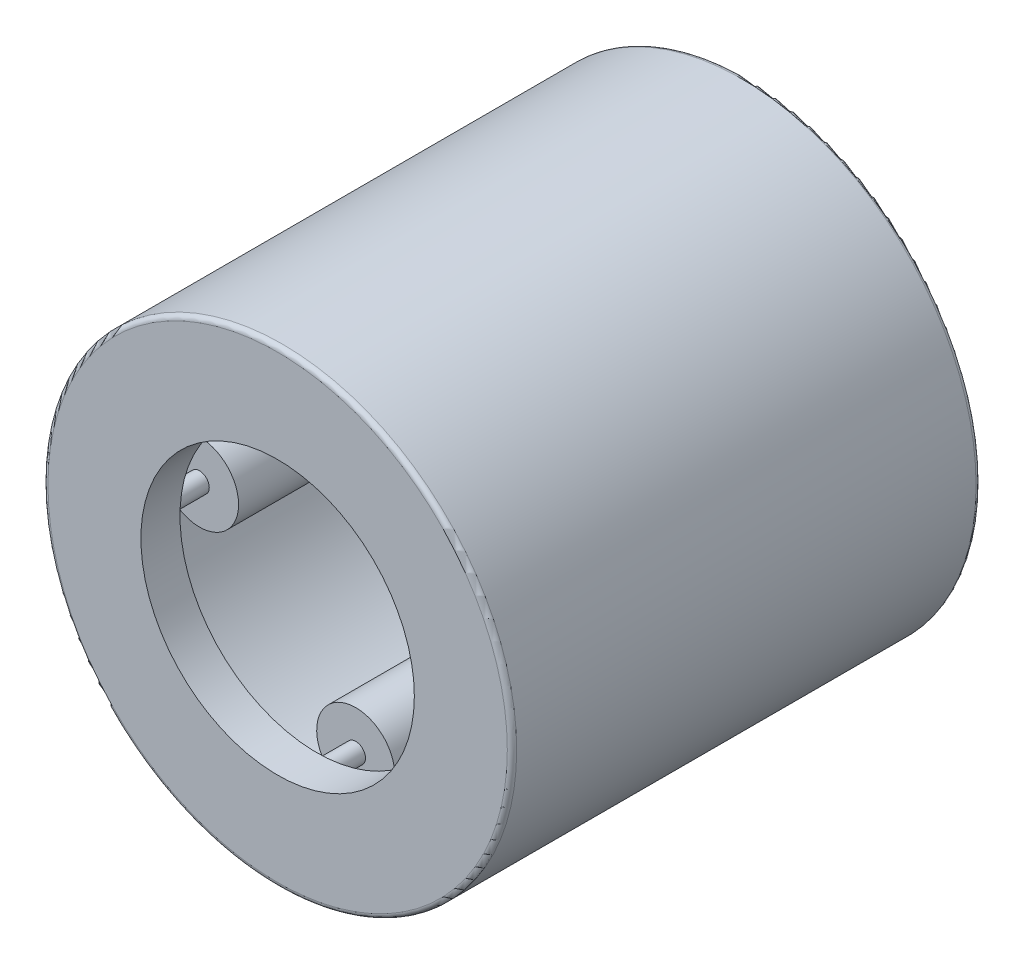
ISO-10303-21;
HEADER;
FILE_DESCRIPTION(('STEP AP214'),'2;1');
FILE_NAME('part.step','',(''),(''),'','','');
FILE_SCHEMA(('AUTOMOTIVE_DESIGN { 1 0 10303 214 1 1 1 1 }'));
ENDSEC;
DATA;
#1=APPLICATION_CONTEXT('core data for automotive mechanical design processes');
#2=APPLICATION_PROTOCOL_DEFINITION('international standard','automotive_design',2000,#1);
#3=PRODUCT_CONTEXT('',#1,'mechanical');
#4=PRODUCT('Part','Part','',(#3));
#5=PRODUCT_RELATED_PRODUCT_CATEGORY('part','',(#4));
#6=PRODUCT_DEFINITION_FORMATION('','',#4);
#7=PRODUCT_DEFINITION_CONTEXT('part definition',#1,'design');
#8=PRODUCT_DEFINITION('design','',#6,#7);
#9=PRODUCT_DEFINITION_SHAPE('','',#8);
#10=(LENGTH_UNIT() NAMED_UNIT(*) SI_UNIT(.MILLI.,.METRE.));
#11=(NAMED_UNIT(*) PLANE_ANGLE_UNIT() SI_UNIT($,.RADIAN.));
#12=(NAMED_UNIT(*) SI_UNIT($,.STERADIAN.) SOLID_ANGLE_UNIT());
#13=UNCERTAINTY_MEASURE_WITH_UNIT(LENGTH_MEASURE(1.E-05),#10,'distance_accuracy_value','');
#14=(GEOMETRIC_REPRESENTATION_CONTEXT(3) GLOBAL_UNCERTAINTY_ASSIGNED_CONTEXT((#13)) GLOBAL_UNIT_ASSIGNED_CONTEXT((#10,
#11,#12)) REPRESENTATION_CONTEXT('',''));
#15=CARTESIAN_POINT('',(0.,0.,0.));
#16=DIRECTION('',(0.,0.,1.));
#17=DIRECTION('',(1.,0.,0.));
#18=AXIS2_PLACEMENT_3D('',#15,#16,#17);
#19=CARTESIAN_POINT('',(-2.11666666666667,0.,2.64583333333333));
#20=DIRECTION('',(0.,0.,-1.));
#21=DIRECTION('',(0.,-1.,0.));
#22=AXIS2_PLACEMENT_3D('',#19,#20,#21);
#23=PLANE('',#22);
#24=CARTESIAN_POINT('',(-2.11666666666667,0.,2.64583333333333));
#25=DIRECTION('',(0.,0.,1.));
#26=DIRECTION('',(0.,1.,0.));
#27=AXIS2_PLACEMENT_3D('',#24,#25,#26);
#28=CIRCLE('',#27,0.132291666666667);
#29=CARTESIAN_POINT('',(-2.11666666666666,0.132291666666689,2.64583333333333));
#30=VERTEX_POINT('',#29);
#31=EDGE_CURVE('E11',#30,#30,#28,.T.);
#32=ORIENTED_EDGE('',*,*,#31,.T.);
#33=EDGE_LOOP('',(#32));
#34=FACE_BOUND('',#33,.T.);
#35=ADVANCED_FACE('F46',(#34),#23,.F.);
#36=CARTESIAN_POINT('',(-2.11666666666667,0.,2.64583333333333));
#37=DIRECTION('',(0.,0.,1.));
#38=DIRECTION('',(0.,1.,0.));
#39=AXIS2_PLACEMENT_3D('',#36,#37,#38);
#40=CYLINDRICAL_SURFACE('',#39,0.132291666666667);
#41=ORIENTED_EDGE('',*,*,#31,.F.);
#42=EDGE_LOOP('',(#41));
#43=FACE_BOUND('',#42,.T.);
#44=CARTESIAN_POINT('',(-2.11666666666667,0.,-2.64583333333333));
#45=DIRECTION('',(0.,0.,1.));
#46=DIRECTION('',(0.,1.,0.));
#47=AXIS2_PLACEMENT_3D('',#44,#45,#46);
#48=CIRCLE('',#47,0.132291666666667);
#49=CARTESIAN_POINT('',(-2.11666666666666,0.132291666666689,-2.64583333333333));
#50=VERTEX_POINT('',#49);
#51=EDGE_CURVE('E52',#50,#50,#48,.T.);
#52=ORIENTED_EDGE('',*,*,#51,.T.);
#53=EDGE_LOOP('',(#52));
#54=FACE_BOUND('',#53,.T.);
#55=ADVANCED_FACE('F58',(#43,#54),#40,.T.);
#56=CARTESIAN_POINT('',(-2.11666666666667,0.,-2.64583333333333));
#57=DIRECTION('',(0.,0.,1.));
#58=DIRECTION('',(0.,1.,0.));
#59=AXIS2_PLACEMENT_3D('',#56,#57,#58);
#60=PLANE('',#59);
#61=ORIENTED_EDGE('',*,*,#51,.F.);
#62=EDGE_LOOP('',(#61));
#63=FACE_BOUND('',#62,.T.);
#64=ADVANCED_FACE('F60',(#63),#60,.F.);
#65=CLOSED_SHELL('',(#35,#55,#64));
#66=MANIFOLD_SOLID_BREP('B2',#65);
#67=CARTESIAN_POINT('',(0.,-2.11666666666667,2.64583333333333));
#68=DIRECTION('',(0.,0.,-1.));
#69=DIRECTION('',(1.,0.,0.));
#70=AXIS2_PLACEMENT_3D('',#67,#68,#69);
#71=PLANE('',#70);
#72=CARTESIAN_POINT('',(0.,-2.11666666666667,2.64583333333333));
#73=DIRECTION('',(0.,0.,1.));
#74=DIRECTION('',(-1.,0.,0.));
#75=AXIS2_PLACEMENT_3D('',#72,#73,#74);
#76=CIRCLE('',#75,0.132291666666667);
#77=CARTESIAN_POINT('',(-0.132291666666682,-2.11666666666666,2.64583333333333));
#78=VERTEX_POINT('',#77);
#79=EDGE_CURVE('E45',#78,#78,#76,.T.);
#80=ORIENTED_EDGE('',*,*,#79,.T.);
#81=EDGE_LOOP('',(#80));
#82=FACE_BOUND('',#81,.T.);
#83=ADVANCED_FACE('F95',(#82),#71,.F.);
#84=CARTESIAN_POINT('',(0.,-2.11666666666667,2.64583333333333));
#85=DIRECTION('',(0.,0.,1.));
#86=DIRECTION('',(-1.,0.,0.));
#87=AXIS2_PLACEMENT_3D('',#84,#85,#86);
#88=CYLINDRICAL_SURFACE('',#87,0.132291666666667);
#89=ORIENTED_EDGE('',*,*,#79,.F.);
#90=EDGE_LOOP('',(#89));
#91=FACE_BOUND('',#90,.T.);
#92=CARTESIAN_POINT('',(0.,-2.11666666666667,-2.64583333333333));
#93=DIRECTION('',(0.,0.,1.));
#94=DIRECTION('',(-1.,0.,0.));
#95=AXIS2_PLACEMENT_3D('',#92,#93,#94);
#96=CIRCLE('',#95,0.132291666666667);
#97=CARTESIAN_POINT('',(-0.132291666666682,-2.11666666666666,-2.64583333333333));
#98=VERTEX_POINT('',#97);
#99=EDGE_CURVE('E101',#98,#98,#96,.T.);
#100=ORIENTED_EDGE('',*,*,#99,.T.);
#101=EDGE_LOOP('',(#100));
#102=FACE_BOUND('',#101,.T.);
#103=ADVANCED_FACE('F107',(#91,#102),#88,.T.);
#104=CARTESIAN_POINT('',(0.,-2.11666666666667,-2.64583333333333));
#105=DIRECTION('',(0.,0.,1.));
#106=DIRECTION('',(-1.,0.,0.));
#107=AXIS2_PLACEMENT_3D('',#104,#105,#106);
#108=PLANE('',#107);
#109=ORIENTED_EDGE('',*,*,#99,.F.);
#110=EDGE_LOOP('',(#109));
#111=FACE_BOUND('',#110,.T.);
#112=ADVANCED_FACE('F109',(#111),#108,.F.);
#113=CLOSED_SHELL('',(#83,#103,#112));
#114=MANIFOLD_SOLID_BREP('B6',#113);
#115=CARTESIAN_POINT('',(2.11666666666667,0.,2.64583333333333));
#116=DIRECTION('',(0.,0.,-1.));
#117=DIRECTION('',(0.,1.,0.));
#118=AXIS2_PLACEMENT_3D('',#115,#116,#117);
#119=PLANE('',#118);
#120=CARTESIAN_POINT('',(2.11666666666667,0.,2.64583333333333));
#121=DIRECTION('',(0.,0.,1.));
#122=DIRECTION('',(0.,-1.,0.));
#123=AXIS2_PLACEMENT_3D('',#120,#121,#122);
#124=CIRCLE('',#123,0.132291666666667);
#125=CARTESIAN_POINT('',(2.11666666666667,-0.132291666666675,2.64583333333333));
#126=VERTEX_POINT('',#125);
#127=EDGE_CURVE('E94',#126,#126,#124,.T.);
#128=ORIENTED_EDGE('',*,*,#127,.T.);
#129=EDGE_LOOP('',(#128));
#130=FACE_BOUND('',#129,.T.);
#131=ADVANCED_FACE('F144',(#130),#119,.F.);
#132=CARTESIAN_POINT('',(2.11666666666667,0.,2.64583333333333));
#133=DIRECTION('',(0.,0.,1.));
#134=DIRECTION('',(0.,-1.,0.));
#135=AXIS2_PLACEMENT_3D('',#132,#133,#134);
#136=CYLINDRICAL_SURFACE('',#135,0.132291666666667);
#137=ORIENTED_EDGE('',*,*,#127,.F.);
#138=EDGE_LOOP('',(#137));
#139=FACE_BOUND('',#138,.T.);
#140=CARTESIAN_POINT('',(2.11666666666667,0.,-2.64583333333333));
#141=DIRECTION('',(0.,0.,1.));
#142=DIRECTION('',(0.,-1.,0.));
#143=AXIS2_PLACEMENT_3D('',#140,#141,#142);
#144=CIRCLE('',#143,0.132291666666667);
#145=CARTESIAN_POINT('',(2.11666666666667,-0.132291666666675,-2.64583333333333));
#146=VERTEX_POINT('',#145);
#147=EDGE_CURVE('E150',#146,#146,#144,.T.);
#148=ORIENTED_EDGE('',*,*,#147,.T.);
#149=EDGE_LOOP('',(#148));
#150=FACE_BOUND('',#149,.T.);
#151=ADVANCED_FACE('F156',(#139,#150),#136,.T.);
#152=CARTESIAN_POINT('',(2.11666666666667,0.,-2.64583333333333));
#153=DIRECTION('',(0.,0.,1.));
#154=DIRECTION('',(0.,-1.,0.));
#155=AXIS2_PLACEMENT_3D('',#152,#153,#154);
#156=PLANE('',#155);
#157=ORIENTED_EDGE('',*,*,#147,.F.);
#158=EDGE_LOOP('',(#157));
#159=FACE_BOUND('',#158,.T.);
#160=ADVANCED_FACE('F158',(#159),#156,.F.);
#161=CLOSED_SHELL('',(#131,#151,#160));
#162=MANIFOLD_SOLID_BREP('B40',#161);
#163=CARTESIAN_POINT('',(-2.64583333333333,0.,-2.11666666666666));
#164=DIRECTION('',(0.,0.,1.));
#165=DIRECTION('',(1.,0.,0.));
#166=AXIS2_PLACEMENT_3D('',#163,#164,#165);
#167=PLANE('',#166);
#168=CARTESIAN_POINT('',(-2.11666666666667,0.,-2.11666666666666));
#169=DIRECTION('',(0.,0.,1.));
#170=DIRECTION('',(1.,0.,0.));
#171=AXIS2_PLACEMENT_3D('',#168,#169,#170);
#172=CIRCLE('',#171,0.529166666666667);
#173=CARTESIAN_POINT('',(-1.5875,0.,-2.11666666666666));
#174=VERTEX_POINT('',#173);
#175=EDGE_CURVE('E207',#174,#174,#172,.T.);
#176=ORIENTED_EDGE('',*,*,#175,.F.);
#177=EDGE_LOOP('',(#176));
#178=FACE_BOUND('',#177,.T.);
#179=CARTESIAN_POINT('',(-2.11666666666667,0.,-2.11666666666666));
#180=DIRECTION('',(0.,0.,1.));
#181=DIRECTION('',(1.,0.,0.));
#182=AXIS2_PLACEMENT_3D('',#179,#180,#181);
#183=CIRCLE('',#182,0.132291666666667);
#184=CARTESIAN_POINT('',(-1.984375,0.,-2.11666666666666));
#185=VERTEX_POINT('',#184);
#186=EDGE_CURVE('E143',#185,#185,#183,.T.);
#187=ORIENTED_EDGE('',*,*,#186,.T.);
#188=EDGE_LOOP('',(#187));
#189=FACE_BOUND('',#188,.T.);
#190=ADVANCED_FACE('F193',(#178,#189),#167,.F.);
#191=CARTESIAN_POINT('',(-2.11666666666667,0.,2.11666666666666));
#192=DIRECTION('',(0.,0.,1.));
#193=DIRECTION('',(1.,0.,0.));
#194=AXIS2_PLACEMENT_3D('',#191,#192,#193);
#195=CYLINDRICAL_SURFACE('',#194,0.132291666666667);
#196=ORIENTED_EDGE('',*,*,#186,.F.);
#197=EDGE_LOOP('',(#196));
#198=FACE_BOUND('',#197,.T.);
#199=CARTESIAN_POINT('',(-2.11666666666667,0.,2.11666666666666));
#200=DIRECTION('',(0.,0.,1.));
#201=DIRECTION('',(1.,0.,0.));
#202=AXIS2_PLACEMENT_3D('',#199,#200,#201);
#203=CIRCLE('',#202,0.132291666666667);
#204=CARTESIAN_POINT('',(-1.984375,0.,2.11666666666666));
#205=VERTEX_POINT('',#204);
#206=EDGE_CURVE('E199',#205,#205,#203,.T.);
#207=ORIENTED_EDGE('',*,*,#206,.T.);
#208=EDGE_LOOP('',(#207));
#209=FACE_BOUND('',#208,.T.);
#210=ADVANCED_FACE('F216',(#198,#209),#195,.F.);
#211=CARTESIAN_POINT('',(-2.64583333333333,0.,2.11666666666666));
#212=DIRECTION('',(0.,0.,-1.));
#213=DIRECTION('',(-1.,0.,0.));
#214=AXIS2_PLACEMENT_3D('',#211,#212,#213);
#215=PLANE('',#214);
#216=ORIENTED_EDGE('',*,*,#206,.F.);
#217=EDGE_LOOP('',(#216));
#218=FACE_BOUND('',#217,.T.);
#219=CARTESIAN_POINT('',(-2.11666666666667,0.,2.11666666666666));
#220=DIRECTION('',(0.,0.,1.));
#221=DIRECTION('',(1.,0.,0.));
#222=AXIS2_PLACEMENT_3D('',#219,#220,#221);
#223=CIRCLE('',#222,0.529166666666667);
#224=CARTESIAN_POINT('',(-1.5875,0.,2.11666666666666));
#225=VERTEX_POINT('',#224);
#226=EDGE_CURVE('E203',#225,#225,#223,.T.);
#227=ORIENTED_EDGE('',*,*,#226,.T.);
#228=EDGE_LOOP('',(#227));
#229=FACE_BOUND('',#228,.T.);
#230=ADVANCED_FACE('F220',(#218,#229),#215,.F.);
#231=CARTESIAN_POINT('',(-2.11666666666667,0.,2.11666666666666));
#232=DIRECTION('',(0.,0.,1.));
#233=DIRECTION('',(1.,0.,0.));
#234=AXIS2_PLACEMENT_3D('',#231,#232,#233);
#235=CYLINDRICAL_SURFACE('',#234,0.529166666666667);
#236=ORIENTED_EDGE('',*,*,#226,.F.);
#237=EDGE_LOOP('',(#236));
#238=FACE_BOUND('',#237,.T.);
#239=ORIENTED_EDGE('',*,*,#175,.T.);
#240=EDGE_LOOP('',(#239));
#241=FACE_BOUND('',#240,.T.);
#242=ADVANCED_FACE('F213',(#238,#241),#235,.T.);
#243=CLOSED_SHELL('',(#190,#210,#230,#242));
#244=MANIFOLD_SOLID_BREP('B89',#243);
#245=CARTESIAN_POINT('',(0.,-2.64583333333333,-2.11666666666666));
#246=DIRECTION('',(0.,0.,1.));
#247=DIRECTION('',(0.,1.,0.));
#248=AXIS2_PLACEMENT_3D('',#245,#246,#247);
#249=PLANE('',#248);
#250=CARTESIAN_POINT('',(0.,-2.11666666666667,-2.11666666666666));
#251=DIRECTION('',(0.,0.,1.));
#252=DIRECTION('',(0.,1.,0.));
#253=AXIS2_PLACEMENT_3D('',#250,#251,#252);
#254=CIRCLE('',#253,0.529166666666667);
#255=CARTESIAN_POINT('',(0.,-1.5875,-2.11666666666666));
#256=VERTEX_POINT('',#255);
#257=EDGE_CURVE('E277',#256,#256,#254,.T.);
#258=ORIENTED_EDGE('',*,*,#257,.F.);
#259=EDGE_LOOP('',(#258));
#260=FACE_BOUND('',#259,.T.);
#261=CARTESIAN_POINT('',(0.,-2.11666666666667,-2.11666666666666));
#262=DIRECTION('',(0.,0.,1.));
#263=DIRECTION('',(0.,1.,0.));
#264=AXIS2_PLACEMENT_3D('',#261,#262,#263);
#265=CIRCLE('',#264,0.132291666666667);
#266=CARTESIAN_POINT('',(0.,-1.984375,-2.11666666666666));
#267=VERTEX_POINT('',#266);
#268=EDGE_CURVE('E192',#267,#267,#265,.T.);
#269=ORIENTED_EDGE('',*,*,#268,.T.);
#270=EDGE_LOOP('',(#269));
#271=FACE_BOUND('',#270,.T.);
#272=ADVANCED_FACE('F263',(#260,#271),#249,.F.);
#273=CARTESIAN_POINT('',(0.,-2.11666666666667,2.11666666666666));
#274=DIRECTION('',(0.,0.,1.));
#275=DIRECTION('',(0.,1.,0.));
#276=AXIS2_PLACEMENT_3D('',#273,#274,#275);
#277=CYLINDRICAL_SURFACE('',#276,0.132291666666667);
#278=ORIENTED_EDGE('',*,*,#268,.F.);
#279=EDGE_LOOP('',(#278));
#280=FACE_BOUND('',#279,.T.);
#281=CARTESIAN_POINT('',(0.,-2.11666666666667,2.11666666666666));
#282=DIRECTION('',(0.,0.,1.));
#283=DIRECTION('',(0.,1.,0.));
#284=AXIS2_PLACEMENT_3D('',#281,#282,#283);
#285=CIRCLE('',#284,0.132291666666667);
#286=CARTESIAN_POINT('',(0.,-1.984375,2.11666666666666));
#287=VERTEX_POINT('',#286);
#288=EDGE_CURVE('E269',#287,#287,#285,.T.);
#289=ORIENTED_EDGE('',*,*,#288,.T.);
#290=EDGE_LOOP('',(#289));
#291=FACE_BOUND('',#290,.T.);
#292=ADVANCED_FACE('F286',(#280,#291),#277,.F.);
#293=CARTESIAN_POINT('',(0.,-2.64583333333333,2.11666666666666));
#294=DIRECTION('',(0.,0.,-1.));
#295=DIRECTION('',(0.,-1.,0.));
#296=AXIS2_PLACEMENT_3D('',#293,#294,#295);
#297=PLANE('',#296);
#298=ORIENTED_EDGE('',*,*,#288,.F.);
#299=EDGE_LOOP('',(#298));
#300=FACE_BOUND('',#299,.T.);
#301=CARTESIAN_POINT('',(0.,-2.11666666666667,2.11666666666666));
#302=DIRECTION('',(0.,0.,1.));
#303=DIRECTION('',(0.,1.,0.));
#304=AXIS2_PLACEMENT_3D('',#301,#302,#303);
#305=CIRCLE('',#304,0.529166666666667);
#306=CARTESIAN_POINT('',(0.,-1.5875,2.11666666666666));
#307=VERTEX_POINT('',#306);
#308=EDGE_CURVE('E273',#307,#307,#305,.T.);
#309=ORIENTED_EDGE('',*,*,#308,.T.);
#310=EDGE_LOOP('',(#309));
#311=FACE_BOUND('',#310,.T.);
#312=ADVANCED_FACE('F290',(#300,#311),#297,.F.);
#313=CARTESIAN_POINT('',(0.,-2.11666666666667,2.11666666666666));
#314=DIRECTION('',(0.,0.,1.));
#315=DIRECTION('',(0.,1.,0.));
#316=AXIS2_PLACEMENT_3D('',#313,#314,#315);
#317=CYLINDRICAL_SURFACE('',#316,0.529166666666667);
#318=ORIENTED_EDGE('',*,*,#308,.F.);
#319=EDGE_LOOP('',(#318));
#320=FACE_BOUND('',#319,.T.);
#321=ORIENTED_EDGE('',*,*,#257,.T.);
#322=EDGE_LOOP('',(#321));
#323=FACE_BOUND('',#322,.T.);
#324=ADVANCED_FACE('F283',(#320,#323),#317,.T.);
#325=CLOSED_SHELL('',(#272,#292,#312,#324));
#326=MANIFOLD_SOLID_BREP('B138',#325);
#327=CARTESIAN_POINT('',(2.64583333333333,0.,-2.11666666666666));
#328=DIRECTION('',(0.,0.,1.));
#329=DIRECTION('',(-1.,0.,0.));
#330=AXIS2_PLACEMENT_3D('',#327,#328,#329);
#331=PLANE('',#330);
#332=CARTESIAN_POINT('',(2.11666666666667,0.,-2.11666666666666));
#333=DIRECTION('',(0.,0.,1.));
#334=DIRECTION('',(-1.,0.,0.));
#335=AXIS2_PLACEMENT_3D('',#332,#333,#334);
#336=CIRCLE('',#335,0.529166666666667);
#337=CARTESIAN_POINT('',(1.5875,0.,-2.11666666666666));
#338=VERTEX_POINT('',#337);
#339=EDGE_CURVE('E347',#338,#338,#336,.T.);
#340=ORIENTED_EDGE('',*,*,#339,.F.);
#341=EDGE_LOOP('',(#340));
#342=FACE_BOUND('',#341,.T.);
#343=CARTESIAN_POINT('',(2.11666666666667,0.,-2.11666666666666));
#344=DIRECTION('',(0.,0.,1.));
#345=DIRECTION('',(-1.,0.,0.));
#346=AXIS2_PLACEMENT_3D('',#343,#344,#345);
#347=CIRCLE('',#346,0.132291666666667);
#348=CARTESIAN_POINT('',(1.984375,0.,-2.11666666666666));
#349=VERTEX_POINT('',#348);
#350=EDGE_CURVE('E262',#349,#349,#347,.T.);
#351=ORIENTED_EDGE('',*,*,#350,.T.);
#352=EDGE_LOOP('',(#351));
#353=FACE_BOUND('',#352,.T.);
#354=ADVANCED_FACE('F333',(#342,#353),#331,.F.);
#355=CARTESIAN_POINT('',(2.11666666666667,0.,2.11666666666666));
#356=DIRECTION('',(0.,0.,1.));
#357=DIRECTION('',(-1.,0.,0.));
#358=AXIS2_PLACEMENT_3D('',#355,#356,#357);
#359=CYLINDRICAL_SURFACE('',#358,0.132291666666667);
#360=ORIENTED_EDGE('',*,*,#350,.F.);
#361=EDGE_LOOP('',(#360));
#362=FACE_BOUND('',#361,.T.);
#363=CARTESIAN_POINT('',(2.11666666666667,0.,2.11666666666666));
#364=DIRECTION('',(0.,0.,1.));
#365=DIRECTION('',(-1.,0.,0.));
#366=AXIS2_PLACEMENT_3D('',#363,#364,#365);
#367=CIRCLE('',#366,0.132291666666667);
#368=CARTESIAN_POINT('',(1.984375,0.,2.11666666666666));
#369=VERTEX_POINT('',#368);
#370=EDGE_CURVE('E339',#369,#369,#367,.T.);
#371=ORIENTED_EDGE('',*,*,#370,.T.);
#372=EDGE_LOOP('',(#371));
#373=FACE_BOUND('',#372,.T.);
#374=ADVANCED_FACE('F356',(#362,#373),#359,.F.);
#375=CARTESIAN_POINT('',(2.64583333333333,0.,2.11666666666666));
#376=DIRECTION('',(0.,0.,-1.));
#377=DIRECTION('',(1.,0.,0.));
#378=AXIS2_PLACEMENT_3D('',#375,#376,#377);
#379=PLANE('',#378);
#380=ORIENTED_EDGE('',*,*,#370,.F.);
#381=EDGE_LOOP('',(#380));
#382=FACE_BOUND('',#381,.T.);
#383=CARTESIAN_POINT('',(2.11666666666667,0.,2.11666666666666));
#384=DIRECTION('',(0.,0.,1.));
#385=DIRECTION('',(-1.,0.,0.));
#386=AXIS2_PLACEMENT_3D('',#383,#384,#385);
#387=CIRCLE('',#386,0.529166666666667);
#388=CARTESIAN_POINT('',(1.5875,0.,2.11666666666666));
#389=VERTEX_POINT('',#388);
#390=EDGE_CURVE('E343',#389,#389,#387,.T.);
#391=ORIENTED_EDGE('',*,*,#390,.T.);
#392=EDGE_LOOP('',(#391));
#393=FACE_BOUND('',#392,.T.);
#394=ADVANCED_FACE('F360',(#382,#393),#379,.F.);
#395=CARTESIAN_POINT('',(2.11666666666667,0.,2.11666666666666));
#396=DIRECTION('',(0.,0.,1.));
#397=DIRECTION('',(-1.,0.,0.));
#398=AXIS2_PLACEMENT_3D('',#395,#396,#397);
#399=CYLINDRICAL_SURFACE('',#398,0.529166666666667);
#400=ORIENTED_EDGE('',*,*,#390,.F.);
#401=EDGE_LOOP('',(#400));
#402=FACE_BOUND('',#401,.T.);
#403=ORIENTED_EDGE('',*,*,#339,.T.);
#404=EDGE_LOOP('',(#403));
#405=FACE_BOUND('',#404,.T.);
#406=ADVANCED_FACE('F353',(#402,#405),#399,.T.);
#407=CLOSED_SHELL('',(#354,#374,#394,#406));
#408=MANIFOLD_SOLID_BREP('B187',#407);
#409=CARTESIAN_POINT('',(0.,2.11666666666667,2.64583333333333));
#410=DIRECTION('',(0.,0.,-1.));
#411=DIRECTION('',(-1.,0.,0.));
#412=AXIS2_PLACEMENT_3D('',#409,#410,#411);
#413=PLANE('',#412);
#414=CARTESIAN_POINT('',(0.,2.11666666666667,2.64583333333333));
#415=DIRECTION('',(0.,0.,1.));
#416=DIRECTION('',(1.,0.,0.));
#417=AXIS2_PLACEMENT_3D('',#414,#415,#416);
#418=CIRCLE('',#417,0.132291666666667);
#419=CARTESIAN_POINT('',(0.132291666666667,2.11666666666667,2.64583333333333));
#420=VERTEX_POINT('',#419);
#421=EDGE_CURVE('E332',#420,#420,#418,.T.);
#422=ORIENTED_EDGE('',*,*,#421,.T.);
#423=EDGE_LOOP('',(#422));
#424=FACE_BOUND('',#423,.T.);
#425=ADVANCED_FACE('F403',(#424),#413,.F.);
#426=CARTESIAN_POINT('',(0.,2.11666666666667,2.64583333333333));
#427=DIRECTION('',(0.,0.,1.));
#428=DIRECTION('',(1.,0.,0.));
#429=AXIS2_PLACEMENT_3D('',#426,#427,#428);
#430=CYLINDRICAL_SURFACE('',#429,0.132291666666667);
#431=ORIENTED_EDGE('',*,*,#421,.F.);
#432=EDGE_LOOP('',(#431));
#433=FACE_BOUND('',#432,.T.);
#434=CARTESIAN_POINT('',(0.,2.11666666666667,-2.64583333333333));
#435=DIRECTION('',(0.,0.,1.));
#436=DIRECTION('',(1.,0.,0.));
#437=AXIS2_PLACEMENT_3D('',#434,#435,#436);
#438=CIRCLE('',#437,0.132291666666667);
#439=CARTESIAN_POINT('',(0.132291666666667,2.11666666666667,-2.64583333333333));
#440=VERTEX_POINT('',#439);
#441=EDGE_CURVE('E409',#440,#440,#438,.T.);
#442=ORIENTED_EDGE('',*,*,#441,.T.);
#443=EDGE_LOOP('',(#442));
#444=FACE_BOUND('',#443,.T.);
#445=ADVANCED_FACE('F415',(#433,#444),#430,.T.);
#446=CARTESIAN_POINT('',(0.,2.11666666666667,-2.64583333333333));
#447=DIRECTION('',(0.,0.,1.));
#448=DIRECTION('',(1.,0.,0.));
#449=AXIS2_PLACEMENT_3D('',#446,#447,#448);
#450=PLANE('',#449);
#451=ORIENTED_EDGE('',*,*,#441,.F.);
#452=EDGE_LOOP('',(#451));
#453=FACE_BOUND('',#452,.T.);
#454=ADVANCED_FACE('F417',(#453),#450,.F.);
#455=CLOSED_SHELL('',(#425,#445,#454));
#456=MANIFOLD_SOLID_BREP('B257',#455);
#457=CARTESIAN_POINT('',(0.,2.64583333333333,-2.11666666666666));
#458=DIRECTION('',(0.,0.,1.));
#459=DIRECTION('',(0.,-1.,0.));
#460=AXIS2_PLACEMENT_3D('',#457,#458,#459);
#461=PLANE('',#460);
#462=CARTESIAN_POINT('',(0.,2.11666666666667,-2.11666666666666));
#463=DIRECTION('',(0.,0.,1.));
#464=DIRECTION('',(0.,-1.,0.));
#465=AXIS2_PLACEMENT_3D('',#462,#463,#464);
#466=CIRCLE('',#465,0.529166666666667);
#467=CARTESIAN_POINT('',(0.,1.5875,-2.11666666666666));
#468=VERTEX_POINT('',#467);
#469=EDGE_CURVE('E465',#468,#468,#466,.T.);
#470=ORIENTED_EDGE('',*,*,#469,.F.);
#471=EDGE_LOOP('',(#470));
#472=FACE_BOUND('',#471,.T.);
#473=CARTESIAN_POINT('',(0.,2.11666666666667,-2.11666666666666));
#474=DIRECTION('',(0.,0.,1.));
#475=DIRECTION('',(0.,-1.,0.));
#476=AXIS2_PLACEMENT_3D('',#473,#474,#475);
#477=CIRCLE('',#476,0.132291666666667);
#478=CARTESIAN_POINT('',(0.,1.984375,-2.11666666666666));
#479=VERTEX_POINT('',#478);
#480=EDGE_CURVE('E402',#479,#479,#477,.T.);
#481=ORIENTED_EDGE('',*,*,#480,.T.);
#482=EDGE_LOOP('',(#481));
#483=FACE_BOUND('',#482,.T.);
#484=ADVANCED_FACE('F451',(#472,#483),#461,.F.);
#485=CARTESIAN_POINT('',(0.,2.11666666666667,2.11666666666666));
#486=DIRECTION('',(0.,0.,1.));
#487=DIRECTION('',(0.,-1.,0.));
#488=AXIS2_PLACEMENT_3D('',#485,#486,#487);
#489=CYLINDRICAL_SURFACE('',#488,0.132291666666667);
#490=ORIENTED_EDGE('',*,*,#480,.F.);
#491=EDGE_LOOP('',(#490));
#492=FACE_BOUND('',#491,.T.);
#493=CARTESIAN_POINT('',(0.,2.11666666666667,2.11666666666666));
#494=DIRECTION('',(0.,0.,1.));
#495=DIRECTION('',(0.,-1.,0.));
#496=AXIS2_PLACEMENT_3D('',#493,#494,#495);
#497=CIRCLE('',#496,0.132291666666667);
#498=CARTESIAN_POINT('',(0.,1.984375,2.11666666666666));
#499=VERTEX_POINT('',#498);
#500=EDGE_CURVE('E457',#499,#499,#497,.T.);
#501=ORIENTED_EDGE('',*,*,#500,.T.);
#502=EDGE_LOOP('',(#501));
#503=FACE_BOUND('',#502,.T.);
#504=ADVANCED_FACE('F474',(#492,#503),#489,.F.);
#505=CARTESIAN_POINT('',(0.,2.64583333333333,2.11666666666666));
#506=DIRECTION('',(0.,0.,-1.));
#507=DIRECTION('',(0.,1.,0.));
#508=AXIS2_PLACEMENT_3D('',#505,#506,#507);
#509=PLANE('',#508);
#510=ORIENTED_EDGE('',*,*,#500,.F.);
#511=EDGE_LOOP('',(#510));
#512=FACE_BOUND('',#511,.T.);
#513=CARTESIAN_POINT('',(0.,2.11666666666667,2.11666666666666));
#514=DIRECTION('',(0.,0.,1.));
#515=DIRECTION('',(0.,-1.,0.));
#516=AXIS2_PLACEMENT_3D('',#513,#514,#515);
#517=CIRCLE('',#516,0.529166666666667);
#518=CARTESIAN_POINT('',(0.,1.5875,2.11666666666666));
#519=VERTEX_POINT('',#518);
#520=EDGE_CURVE('E461',#519,#519,#517,.T.);
#521=ORIENTED_EDGE('',*,*,#520,.T.);
#522=EDGE_LOOP('',(#521));
#523=FACE_BOUND('',#522,.T.);
#524=ADVANCED_FACE('F478',(#512,#523),#509,.F.);
#525=CARTESIAN_POINT('',(0.,2.11666666666667,2.11666666666666));
#526=DIRECTION('',(0.,0.,1.));
#527=DIRECTION('',(0.,-1.,0.));
#528=AXIS2_PLACEMENT_3D('',#525,#526,#527);
#529=CYLINDRICAL_SURFACE('',#528,0.529166666666667);
#530=ORIENTED_EDGE('',*,*,#520,.F.);
#531=EDGE_LOOP('',(#530));
#532=FACE_BOUND('',#531,.T.);
#533=ORIENTED_EDGE('',*,*,#469,.T.);
#534=EDGE_LOOP('',(#533));
#535=FACE_BOUND('',#534,.T.);
#536=ADVANCED_FACE('F471',(#532,#535),#529,.T.);
#537=CLOSED_SHELL('',(#484,#504,#524,#536));
#538=MANIFOLD_SOLID_BREP('B327',#537);
#539=CARTESIAN_POINT('',(0.,3.175,3.175));
#540=DIRECTION('',(0.,0.,-1.));
#541=DIRECTION('',(-1.,0.,0.));
#542=AXIS2_PLACEMENT_3D('',#539,#540,#541);
#543=PLANE('',#542);
#544=CARTESIAN_POINT('',(0.,0.,3.175));
#545=DIRECTION('',(0.,0.,-1.));
#546=DIRECTION('',(-1.,0.,0.));
#547=AXIS2_PLACEMENT_3D('',#544,#545,#546);
#548=CIRCLE('',#547,3.1115);
#549=CARTESIAN_POINT('',(-3.1115,0.,3.175));
#550=VERTEX_POINT('',#549);
#551=EDGE_CURVE('E450',#550,#550,#548,.F.);
#552=ORIENTED_EDGE('',*,*,#551,.T.);
#553=EDGE_LOOP('',(#552));
#554=FACE_BOUND('',#553,.T.);
#555=CARTESIAN_POINT('',(0.,0.,3.175));
#556=DIRECTION('',(0.,0.,1.));
#557=DIRECTION('',(1.,0.,0.));
#558=AXIS2_PLACEMENT_3D('',#555,#556,#557);
#559=CIRCLE('',#558,1.85208333333333);
#560=CARTESIAN_POINT('',(1.85208333333333,0.,3.175));
#561=VERTEX_POINT('',#560);
#562=EDGE_CURVE('E533',#561,#561,#559,.T.);
#563=ORIENTED_EDGE('',*,*,#562,.F.);
#564=EDGE_LOOP('',(#563));
#565=FACE_BOUND('',#564,.T.);
#566=ADVANCED_FACE('F513',(#554,#565),#543,.F.);
#567=CARTESIAN_POINT('',(0.,0.,3.175));
#568=DIRECTION('',(0.,0.,1.));
#569=DIRECTION('',(1.,0.,0.));
#570=AXIS2_PLACEMENT_3D('',#567,#568,#569);
#571=CYLINDRICAL_SURFACE('',#570,1.85208333333333);
#572=CARTESIAN_POINT('',(0.,0.,2.64583333333333));
#573=DIRECTION('',(0.,0.,1.));
#574=DIRECTION('',(1.,0.,0.));
#575=AXIS2_PLACEMENT_3D('',#572,#573,#574);
#576=CIRCLE('',#575,1.85208333333333);
#577=CARTESIAN_POINT('',(1.85208333333333,0.,2.64583333333333));
#578=VERTEX_POINT('',#577);
#579=EDGE_CURVE('E536',#578,#578,#576,.T.);
#580=ORIENTED_EDGE('',*,*,#579,.F.);
#581=EDGE_LOOP('',(#580));
#582=FACE_BOUND('',#581,.T.);
#583=ORIENTED_EDGE('',*,*,#562,.T.);
#584=EDGE_LOOP('',(#583));
#585=FACE_BOUND('',#584,.T.);
#586=ADVANCED_FACE('F575',(#582,#585),#571,.F.);
#587=CARTESIAN_POINT('',(0.,1.85208333333333,2.64583333333333));
#588=DIRECTION('',(0.,0.,1.));
#589=DIRECTION('',(1.,0.,0.));
#590=AXIS2_PLACEMENT_3D('',#587,#588,#589);
#591=PLANE('',#590);
#592=CARTESIAN_POINT('',(0.,0.,2.64583333333333));
#593=DIRECTION('',(0.,0.,1.));
#594=DIRECTION('',(1.,0.,0.));
#595=AXIS2_PLACEMENT_3D('',#592,#593,#594);
#596=CIRCLE('',#595,2.64583333333333);
#597=CARTESIAN_POINT('',(2.64583333333333,0.,2.64583333333333));
#598=VERTEX_POINT('',#597);
#599=EDGE_CURVE('E539',#598,#598,#596,.T.);
#600=ORIENTED_EDGE('',*,*,#599,.F.);
#601=EDGE_LOOP('',(#600));
#602=FACE_BOUND('',#601,.T.);
#603=ORIENTED_EDGE('',*,*,#579,.T.);
#604=EDGE_LOOP('',(#603));
#605=FACE_BOUND('',#604,.T.);
#606=ADVANCED_FACE('F569',(#602,#605),#591,.F.);
#607=CARTESIAN_POINT('',(0.,0.,3.175));
#608=DIRECTION('',(0.,0.,1.));
#609=DIRECTION('',(1.,0.,0.));
#610=AXIS2_PLACEMENT_3D('',#607,#608,#609);
#611=CYLINDRICAL_SURFACE('',#610,2.64583333333333);
#612=CARTESIAN_POINT('',(0.,0.,-2.64583333333333));
#613=DIRECTION('',(0.,0.,1.));
#614=DIRECTION('',(1.,0.,0.));
#615=AXIS2_PLACEMENT_3D('',#612,#613,#614);
#616=CIRCLE('',#615,2.64583333333333);
#617=CARTESIAN_POINT('',(2.64583333333333,0.,-2.64583333333333));
#618=VERTEX_POINT('',#617);
#619=EDGE_CURVE('E542',#618,#618,#616,.T.);
#620=ORIENTED_EDGE('',*,*,#619,.F.);
#621=EDGE_LOOP('',(#620));
#622=FACE_BOUND('',#621,.T.);
#623=ORIENTED_EDGE('',*,*,#599,.T.);
#624=EDGE_LOOP('',(#623));
#625=FACE_BOUND('',#624,.T.);
#626=ADVANCED_FACE('F563',(#622,#625),#611,.F.);
#627=CARTESIAN_POINT('',(0.,2.64583333333333,-2.64583333333333));
#628=DIRECTION('',(0.,0.,-1.));
#629=DIRECTION('',(-1.,0.,0.));
#630=AXIS2_PLACEMENT_3D('',#627,#628,#629);
#631=PLANE('',#630);
#632=CARTESIAN_POINT('',(0.,0.,-2.64583333333333));
#633=DIRECTION('',(0.,0.,1.));
#634=DIRECTION('',(1.,0.,0.));
#635=AXIS2_PLACEMENT_3D('',#632,#633,#634);
#636=CIRCLE('',#635,1.85208333333333);
#637=CARTESIAN_POINT('',(1.85208333333333,0.,-2.64583333333333));
#638=VERTEX_POINT('',#637);
#639=EDGE_CURVE('E545',#638,#638,#636,.T.);
#640=ORIENTED_EDGE('',*,*,#639,.F.);
#641=EDGE_LOOP('',(#640));
#642=FACE_BOUND('',#641,.T.);
#643=ORIENTED_EDGE('',*,*,#619,.T.);
#644=EDGE_LOOP('',(#643));
#645=FACE_BOUND('',#644,.T.);
#646=ADVANCED_FACE('F557',(#642,#645),#631,.F.);
#647=CARTESIAN_POINT('',(0.,0.,3.175));
#648=DIRECTION('',(0.,0.,1.));
#649=DIRECTION('',(1.,0.,0.));
#650=AXIS2_PLACEMENT_3D('',#647,#648,#649);
#651=CYLINDRICAL_SURFACE('',#650,1.85208333333333);
#652=CARTESIAN_POINT('',(0.,0.,-3.175));
#653=DIRECTION('',(0.,0.,1.));
#654=DIRECTION('',(1.,0.,0.));
#655=AXIS2_PLACEMENT_3D('',#652,#653,#654);
#656=CIRCLE('',#655,1.85208333333333);
#657=CARTESIAN_POINT('',(1.85208333333333,0.,-3.175));
#658=VERTEX_POINT('',#657);
#659=EDGE_CURVE('E548',#658,#658,#656,.T.);
#660=ORIENTED_EDGE('',*,*,#659,.F.);
#661=EDGE_LOOP('',(#660));
#662=FACE_BOUND('',#661,.T.);
#663=ORIENTED_EDGE('',*,*,#639,.T.);
#664=EDGE_LOOP('',(#663));
#665=FACE_BOUND('',#664,.T.);
#666=ADVANCED_FACE('F554',(#662,#665),#651,.F.);
#667=CARTESIAN_POINT('',(0.,1.85208333333333,-3.175));
#668=DIRECTION('',(0.,0.,1.));
#669=DIRECTION('',(1.,0.,0.));
#670=AXIS2_PLACEMENT_3D('',#667,#668,#669);
#671=PLANE('',#670);
#672=CARTESIAN_POINT('',(0.,0.,-3.175));
#673=DIRECTION('',(0.,0.,1.));
#674=DIRECTION('',(1.,0.,0.));
#675=AXIS2_PLACEMENT_3D('',#672,#673,#674);
#676=CIRCLE('',#675,3.1115);
#677=CARTESIAN_POINT('',(3.1115,0.,-3.175));
#678=VERTEX_POINT('',#677);
#679=EDGE_CURVE('E520',#678,#678,#676,.F.);
#680=ORIENTED_EDGE('',*,*,#679,.T.);
#681=EDGE_LOOP('',(#680));
#682=FACE_BOUND('',#681,.T.);
#683=ORIENTED_EDGE('',*,*,#659,.T.);
#684=EDGE_LOOP('',(#683));
#685=FACE_BOUND('',#684,.T.);
#686=ADVANCED_FACE('F552',(#682,#685),#671,.F.);
#687=CARTESIAN_POINT('',(0.,0.,3.175));
#688=DIRECTION('',(0.,0.,1.));
#689=DIRECTION('',(1.,0.,0.));
#690=AXIS2_PLACEMENT_3D('',#687,#688,#689);
#691=CYLINDRICAL_SURFACE('',#690,3.175);
#692=CARTESIAN_POINT('',(0.,0.,-3.1115));
#693=DIRECTION('',(0.,0.,1.));
#694=DIRECTION('',(1.,0.,0.));
#695=AXIS2_PLACEMENT_3D('',#692,#693,#694);
#696=CIRCLE('',#695,3.175);
#697=CARTESIAN_POINT('',(3.175,0.,-3.1115));
#698=VERTEX_POINT('',#697);
#699=EDGE_CURVE('E524',#698,#698,#696,.T.);
#700=ORIENTED_EDGE('',*,*,#699,.T.);
#701=EDGE_LOOP('',(#700));
#702=FACE_BOUND('',#701,.T.);
#703=CARTESIAN_POINT('',(0.,0.,3.1115));
#704=DIRECTION('',(0.,0.,-1.));
#705=DIRECTION('',(-1.,0.,0.));
#706=AXIS2_PLACEMENT_3D('',#703,#704,#705);
#707=CIRCLE('',#706,3.175);
#708=CARTESIAN_POINT('',(-3.175,0.,3.1115));
#709=VERTEX_POINT('',#708);
#710=EDGE_CURVE('E528',#709,#709,#707,.T.);
#711=ORIENTED_EDGE('',*,*,#710,.T.);
#712=EDGE_LOOP('',(#711));
#713=FACE_BOUND('',#712,.T.);
#714=ADVANCED_FACE('F590',(#702,#713),#691,.T.);
#715=CARTESIAN_POINT('',(0.,0.,-3.1115));
#716=DIRECTION('',(0.,0.,1.));
#717=DIRECTION('',(1.,0.,0.));
#718=AXIS2_PLACEMENT_3D('',#715,#716,#717);
#719=TOROIDAL_SURFACE('',#718,3.1115,0.0635);
#720=ORIENTED_EDGE('',*,*,#679,.F.);
#721=EDGE_LOOP('',(#720));
#722=FACE_BOUND('',#721,.T.);
#723=ORIENTED_EDGE('',*,*,#699,.F.);
#724=EDGE_LOOP('',(#723));
#725=FACE_BOUND('',#724,.T.);
#726=ADVANCED_FACE('F588',(#722,#725),#719,.T.);
#727=CARTESIAN_POINT('',(0.,0.,3.1115));
#728=DIRECTION('',(0.,0.,-1.));
#729=DIRECTION('',(-1.,0.,0.));
#730=AXIS2_PLACEMENT_3D('',#727,#728,#729);
#731=TOROIDAL_SURFACE('',#730,3.1115,0.0635);
#732=ORIENTED_EDGE('',*,*,#710,.F.);
#733=EDGE_LOOP('',(#732));
#734=FACE_BOUND('',#733,.T.);
#735=ORIENTED_EDGE('',*,*,#551,.F.);
#736=EDGE_LOOP('',(#735));
#737=FACE_BOUND('',#736,.T.);
#738=ADVANCED_FACE('F515',(#734,#737),#731,.T.);
#739=CLOSED_SHELL('',(#566,#586,#606,#626,#646,#666,#686,#714,#726,#738));
#740=MANIFOLD_SOLID_BREP('B397',#739);
#741=ADVANCED_BREP_SHAPE_REPRESENTATION('',(#18,#66,#114,#162,#244,#326,#408,#456,#538,#740),#14);
#742=SHAPE_DEFINITION_REPRESENTATION(#9,#741);
ENDSEC;
END-ISO-10303-21;
